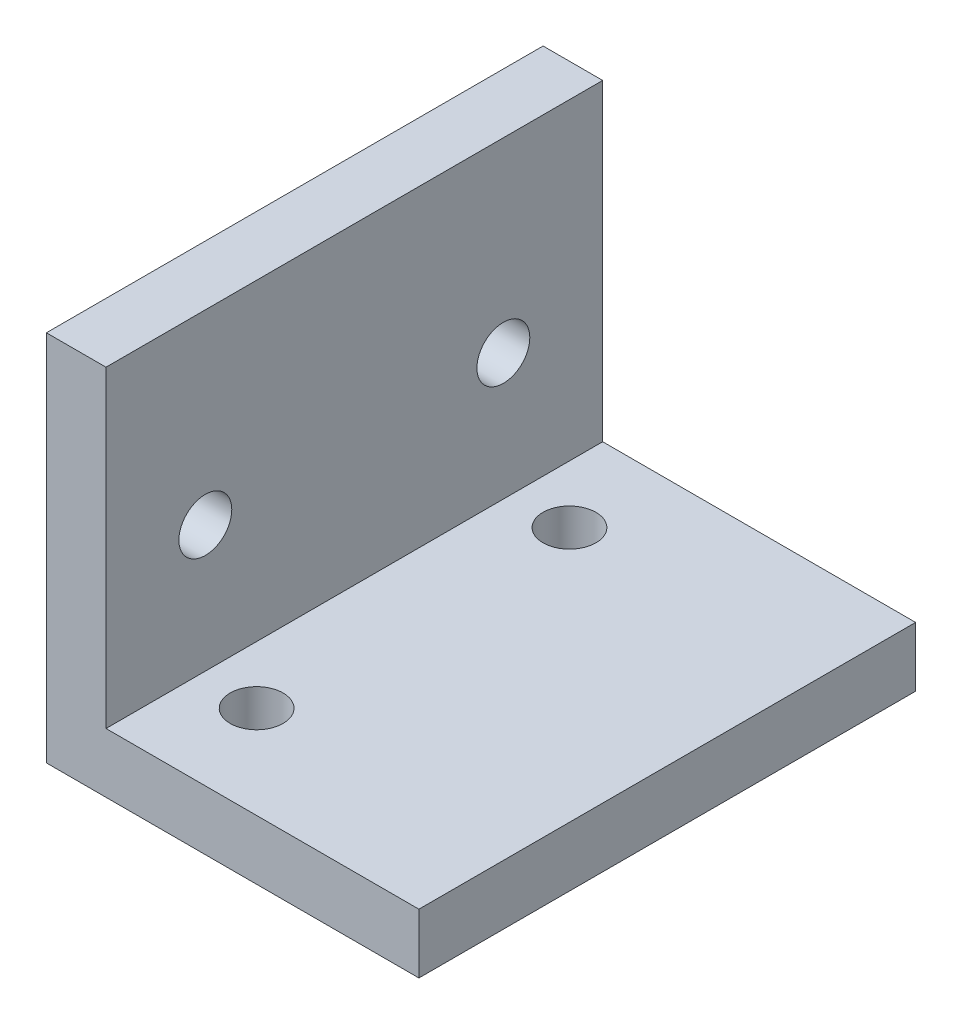
ISO-10303-21;
HEADER;
FILE_DESCRIPTION(('STEP AP214'),'2;1');
FILE_NAME('part.step','',(''),(''),'','','');
FILE_SCHEMA(('AUTOMOTIVE_DESIGN { 1 0 10303 214 1 1 1 1 }'));
ENDSEC;
DATA;
#1=APPLICATION_CONTEXT('core data for automotive mechanical design processes');
#2=APPLICATION_PROTOCOL_DEFINITION('international standard','automotive_design',2000,#1);
#3=PRODUCT_CONTEXT('',#1,'mechanical');
#4=PRODUCT('Part','Part','',(#3));
#5=PRODUCT_RELATED_PRODUCT_CATEGORY('part','',(#4));
#6=PRODUCT_DEFINITION_FORMATION('','',#4);
#7=PRODUCT_DEFINITION_CONTEXT('part definition',#1,'design');
#8=PRODUCT_DEFINITION('design','',#6,#7);
#9=PRODUCT_DEFINITION_SHAPE('','',#8);
#10=(LENGTH_UNIT() NAMED_UNIT(*) SI_UNIT(.MILLI.,.METRE.));
#11=(NAMED_UNIT(*) PLANE_ANGLE_UNIT() SI_UNIT($,.RADIAN.));
#12=(NAMED_UNIT(*) SI_UNIT($,.STERADIAN.) SOLID_ANGLE_UNIT());
#13=UNCERTAINTY_MEASURE_WITH_UNIT(LENGTH_MEASURE(1.E-05),#10,'distance_accuracy_value','');
#14=(GEOMETRIC_REPRESENTATION_CONTEXT(3) GLOBAL_UNCERTAINTY_ASSIGNED_CONTEXT((#13)) GLOBAL_UNIT_ASSIGNED_CONTEXT((#10,
#11,#12)) REPRESENTATION_CONTEXT('',''));
#15=CARTESIAN_POINT('',(0.,0.,0.));
#16=DIRECTION('',(0.,0.,1.));
#17=DIRECTION('',(1.,0.,0.));
#18=AXIS2_PLACEMENT_3D('',#15,#16,#17);
#19=CARTESIAN_POINT('',(0.,0.,25.4));
#20=DIRECTION('',(1.,0.,0.));
#21=DIRECTION('',(0.,0.,-1.));
#22=AXIS2_PLACEMENT_3D('',#19,#20,#21);
#23=PLANE('',#22);
#24=CARTESIAN_POINT('',(0.,9.525,20.32));
#25=DIRECTION('',(1.,0.,0.));
#26=DIRECTION('',(0.,0.,-1.));
#27=AXIS2_PLACEMENT_3D('',#24,#25,#26);
#28=CIRCLE('',#27,1.35255);
#29=CARTESIAN_POINT('',(0.,9.525,18.96745));
#30=VERTEX_POINT('',#29);
#31=EDGE_CURVE('E175',#30,#30,#28,.T.);
#32=ORIENTED_EDGE('',*,*,#31,.T.);
#33=EDGE_LOOP('',(#32));
#34=FACE_BOUND('',#33,.T.);
#35=CARTESIAN_POINT('',(0.,9.525,5.08));
#36=DIRECTION('',(1.,0.,0.));
#37=DIRECTION('',(0.,0.,-1.));
#38=AXIS2_PLACEMENT_3D('',#35,#36,#37);
#39=CIRCLE('',#38,1.35255);
#40=CARTESIAN_POINT('',(0.,9.525,3.72745));
#41=VERTEX_POINT('',#40);
#42=EDGE_CURVE('E132',#41,#41,#39,.T.);
#43=ORIENTED_EDGE('',*,*,#42,.T.);
#44=EDGE_LOOP('',(#43));
#45=FACE_BOUND('',#44,.T.);
#46=DIRECTION('',(0.,-1.,0.));
#47=VECTOR('',#46,1.);
#48=CARTESIAN_POINT('',(0.,0.,0.));
#49=LINE('',#48,#47);
#50=CARTESIAN_POINT('',(0.,19.05,0.));
#51=VERTEX_POINT('',#50);
#52=CARTESIAN_POINT('',(0.,0.,0.));
#53=VERTEX_POINT('',#52);
#54=EDGE_CURVE('E128',#51,#53,#49,.T.);
#55=ORIENTED_EDGE('',*,*,#54,.T.);
#56=DIRECTION('',(0.,0.,-1.));
#57=VECTOR('',#56,1.);
#58=CARTESIAN_POINT('',(0.,0.,25.4));
#59=LINE('',#58,#57);
#60=CARTESIAN_POINT('',(0.,0.,25.4));
#61=VERTEX_POINT('',#60);
#62=EDGE_CURVE('E13',#61,#53,#59,.T.);
#63=ORIENTED_EDGE('',*,*,#62,.F.);
#64=DIRECTION('',(0.,-1.,0.));
#65=VECTOR('',#64,1.);
#66=CARTESIAN_POINT('',(0.,0.,25.4));
#67=LINE('',#66,#65);
#68=CARTESIAN_POINT('',(0.,19.05,25.4));
#69=VERTEX_POINT('',#68);
#70=EDGE_CURVE('E139',#69,#61,#67,.T.);
#71=ORIENTED_EDGE('',*,*,#70,.F.);
#72=DIRECTION('',(0.,0.,-1.));
#73=VECTOR('',#72,1.);
#74=CARTESIAN_POINT('',(0.,19.05,25.4));
#75=LINE('',#74,#73);
#76=EDGE_CURVE('E124',#69,#51,#75,.T.);
#77=ORIENTED_EDGE('',*,*,#76,.T.);
#78=EDGE_LOOP('',(#55,#63,#71,#77));
#79=FACE_BOUND('',#78,.T.);
#80=ADVANCED_FACE('F44',(#34,#45,#79),#23,.F.);
#81=CARTESIAN_POINT('',(0.,0.,25.4));
#82=DIRECTION('',(0.,1.,0.));
#83=DIRECTION('',(0.,0.,1.));
#84=AXIS2_PLACEMENT_3D('',#81,#82,#83);
#85=PLANE('',#84);
#86=CARTESIAN_POINT('',(6.00000000000003,0.,20.65));
#87=DIRECTION('',(0.,1.,0.));
#88=DIRECTION('',(0.,0.,1.));
#89=AXIS2_PLACEMENT_3D('',#86,#87,#88);
#90=CIRCLE('',#89,1.35255);
#91=CARTESIAN_POINT('',(6.00000000000003,0.,22.00255));
#92=VERTEX_POINT('',#91);
#93=EDGE_CURVE('E196',#92,#92,#90,.T.);
#94=ORIENTED_EDGE('',*,*,#93,.T.);
#95=EDGE_LOOP('',(#94));
#96=FACE_BOUND('',#95,.T.);
#97=CARTESIAN_POINT('',(6.00000000000003,0.,4.65000000000003));
#98=DIRECTION('',(0.,1.,0.));
#99=DIRECTION('',(0.,0.,1.));
#100=AXIS2_PLACEMENT_3D('',#97,#98,#99);
#101=CIRCLE('',#100,1.35255);
#102=CARTESIAN_POINT('',(6.00000000000003,0.,6.00255000000003));
#103=VERTEX_POINT('',#102);
#104=EDGE_CURVE('E190',#103,#103,#101,.T.);
#105=ORIENTED_EDGE('',*,*,#104,.T.);
#106=EDGE_LOOP('',(#105));
#107=FACE_BOUND('',#106,.T.);
#108=DIRECTION('',(1.,0.,0.));
#109=VECTOR('',#108,1.);
#110=CARTESIAN_POINT('',(0.,0.,0.));
#111=LINE('',#110,#109);
#112=CARTESIAN_POINT('',(19.05,0.,0.));
#113=VERTEX_POINT('',#112);
#114=EDGE_CURVE('E131',#53,#113,#111,.T.);
#115=ORIENTED_EDGE('',*,*,#114,.T.);
#116=DIRECTION('',(0.,0.,-1.));
#117=VECTOR('',#116,1.);
#118=CARTESIAN_POINT('',(19.05,0.,25.4));
#119=LINE('',#118,#117);
#120=CARTESIAN_POINT('',(19.05,0.,25.4));
#121=VERTEX_POINT('',#120);
#122=EDGE_CURVE('E52',#121,#113,#119,.T.);
#123=ORIENTED_EDGE('',*,*,#122,.F.);
#124=DIRECTION('',(1.,0.,0.));
#125=VECTOR('',#124,1.);
#126=CARTESIAN_POINT('',(0.,0.,25.4));
#127=LINE('',#126,#125);
#128=EDGE_CURVE('E97',#61,#121,#127,.T.);
#129=ORIENTED_EDGE('',*,*,#128,.F.);
#130=ORIENTED_EDGE('',*,*,#62,.T.);
#131=EDGE_LOOP('',(#115,#123,#129,#130));
#132=FACE_BOUND('',#131,.T.);
#133=ADVANCED_FACE('F165',(#96,#107,#132),#85,.F.);
#134=CARTESIAN_POINT('',(19.05,0.,25.4));
#135=DIRECTION('',(-1.,0.,0.));
#136=DIRECTION('',(0.,-1.,0.));
#137=AXIS2_PLACEMENT_3D('',#134,#135,#136);
#138=PLANE('',#137);
#139=DIRECTION('',(0.,1.,0.));
#140=VECTOR('',#139,1.);
#141=CARTESIAN_POINT('',(19.05,0.,0.));
#142=LINE('',#141,#140);
#143=CARTESIAN_POINT('',(19.05,3.048,0.));
#144=VERTEX_POINT('',#143);
#145=EDGE_CURVE('E134',#113,#144,#142,.T.);
#146=ORIENTED_EDGE('',*,*,#145,.T.);
#147=DIRECTION('',(0.,0.,-1.));
#148=VECTOR('',#147,1.);
#149=CARTESIAN_POINT('',(19.05,3.048,25.4));
#150=LINE('',#149,#148);
#151=CARTESIAN_POINT('',(19.05,3.048,25.4));
#152=VERTEX_POINT('',#151);
#153=EDGE_CURVE('E119',#152,#144,#150,.T.);
#154=ORIENTED_EDGE('',*,*,#153,.F.);
#155=DIRECTION('',(0.,1.,0.));
#156=VECTOR('',#155,1.);
#157=CARTESIAN_POINT('',(19.05,0.,25.4));
#158=LINE('',#157,#156);
#159=EDGE_CURVE('E110',#121,#152,#158,.T.);
#160=ORIENTED_EDGE('',*,*,#159,.F.);
#161=ORIENTED_EDGE('',*,*,#122,.T.);
#162=EDGE_LOOP('',(#146,#154,#160,#161));
#163=FACE_BOUND('',#162,.T.);
#164=ADVANCED_FACE('F145',(#163),#138,.F.);
#165=CARTESIAN_POINT('',(19.05,3.048,25.4));
#166=DIRECTION('',(0.,-1.,0.));
#167=DIRECTION('',(1.,0.,0.));
#168=AXIS2_PLACEMENT_3D('',#165,#166,#167);
#169=PLANE('',#168);
#170=CARTESIAN_POINT('',(6.00000000000003,3.048,20.65));
#171=DIRECTION('',(0.,1.,0.));
#172=DIRECTION('',(0.,0.,1.));
#173=AXIS2_PLACEMENT_3D('',#170,#171,#172);
#174=CIRCLE('',#173,1.35254999999999);
#175=CARTESIAN_POINT('',(6.00000000000003,3.048,22.00255));
#176=VERTEX_POINT('',#175);
#177=EDGE_CURVE('E199',#176,#176,#174,.T.);
#178=ORIENTED_EDGE('',*,*,#177,.F.);
#179=EDGE_LOOP('',(#178));
#180=FACE_BOUND('',#179,.T.);
#181=CARTESIAN_POINT('',(6.00000000000003,3.048,4.65000000000003));
#182=DIRECTION('',(0.,1.,0.));
#183=DIRECTION('',(0.,0.,1.));
#184=AXIS2_PLACEMENT_3D('',#181,#182,#183);
#185=CIRCLE('',#184,1.35254999999999);
#186=CARTESIAN_POINT('',(6.00000000000003,3.048,6.00255000000002));
#187=VERTEX_POINT('',#186);
#188=EDGE_CURVE('E193',#187,#187,#185,.T.);
#189=ORIENTED_EDGE('',*,*,#188,.F.);
#190=EDGE_LOOP('',(#189));
#191=FACE_BOUND('',#190,.T.);
#192=DIRECTION('',(-1.,0.,0.));
#193=VECTOR('',#192,1.);
#194=CARTESIAN_POINT('',(19.05,3.048,0.));
#195=LINE('',#194,#193);
#196=CARTESIAN_POINT('',(3.048,3.048,0.));
#197=VERTEX_POINT('',#196);
#198=EDGE_CURVE('E118',#144,#197,#195,.T.);
#199=ORIENTED_EDGE('',*,*,#198,.T.);
#200=DIRECTION('',(0.,0.,-1.));
#201=VECTOR('',#200,1.);
#202=CARTESIAN_POINT('',(3.048,3.048,25.4));
#203=LINE('',#202,#201);
#204=CARTESIAN_POINT('',(3.048,3.048,25.4));
#205=VERTEX_POINT('',#204);
#206=EDGE_CURVE('E115',#205,#197,#203,.T.);
#207=ORIENTED_EDGE('',*,*,#206,.F.);
#208=DIRECTION('',(-1.,0.,0.));
#209=VECTOR('',#208,1.);
#210=CARTESIAN_POINT('',(19.05,3.048,25.4));
#211=LINE('',#210,#209);
#212=EDGE_CURVE('E104',#152,#205,#211,.T.);
#213=ORIENTED_EDGE('',*,*,#212,.F.);
#214=ORIENTED_EDGE('',*,*,#153,.T.);
#215=EDGE_LOOP('',(#199,#207,#213,#214));
#216=FACE_BOUND('',#215,.T.);
#217=ADVANCED_FACE('F116',(#180,#191,#216),#169,.F.);
#218=CARTESIAN_POINT('',(3.048,19.05,25.4));
#219=DIRECTION('',(-1.,0.,0.));
#220=DIRECTION('',(0.,-1.,0.));
#221=AXIS2_PLACEMENT_3D('',#218,#219,#220);
#222=PLANE('',#221);
#223=CARTESIAN_POINT('',(3.048,9.525,20.32));
#224=DIRECTION('',(1.,0.,0.));
#225=DIRECTION('',(0.,0.,-1.));
#226=AXIS2_PLACEMENT_3D('',#223,#224,#225);
#227=CIRCLE('',#226,1.35254999999999);
#228=CARTESIAN_POINT('',(3.048,9.525,18.96745));
#229=VERTEX_POINT('',#228);
#230=EDGE_CURVE('E187',#229,#229,#227,.T.);
#231=ORIENTED_EDGE('',*,*,#230,.F.);
#232=EDGE_LOOP('',(#231));
#233=FACE_BOUND('',#232,.T.);
#234=CARTESIAN_POINT('',(3.048,9.525,5.08));
#235=DIRECTION('',(1.,0.,0.));
#236=DIRECTION('',(0.,0.,-1.));
#237=AXIS2_PLACEMENT_3D('',#234,#235,#236);
#238=CIRCLE('',#237,1.35254999999999);
#239=CARTESIAN_POINT('',(3.048,9.525,3.72745000000001));
#240=VERTEX_POINT('',#239);
#241=EDGE_CURVE('E179',#240,#240,#238,.T.);
#242=ORIENTED_EDGE('',*,*,#241,.F.);
#243=EDGE_LOOP('',(#242));
#244=FACE_BOUND('',#243,.T.);
#245=DIRECTION('',(0.,1.,0.));
#246=VECTOR('',#245,1.);
#247=CARTESIAN_POINT('',(3.048,19.05,0.));
#248=LINE('',#247,#246);
#249=CARTESIAN_POINT('',(3.048,19.05,0.));
#250=VERTEX_POINT('',#249);
#251=EDGE_CURVE('E83',#197,#250,#248,.T.);
#252=ORIENTED_EDGE('',*,*,#251,.T.);
#253=DIRECTION('',(0.,0.,-1.));
#254=VECTOR('',#253,1.);
#255=CARTESIAN_POINT('',(3.048,19.05,25.4));
#256=LINE('',#255,#254);
#257=CARTESIAN_POINT('',(3.048,19.05,25.4));
#258=VERTEX_POINT('',#257);
#259=EDGE_CURVE('E120',#258,#250,#256,.T.);
#260=ORIENTED_EDGE('',*,*,#259,.F.);
#261=DIRECTION('',(0.,1.,0.));
#262=VECTOR('',#261,1.);
#263=CARTESIAN_POINT('',(3.048,19.05,25.4));
#264=LINE('',#263,#262);
#265=EDGE_CURVE('E108',#205,#258,#264,.T.);
#266=ORIENTED_EDGE('',*,*,#265,.F.);
#267=ORIENTED_EDGE('',*,*,#206,.T.);
#268=EDGE_LOOP('',(#252,#260,#266,#267));
#269=FACE_BOUND('',#268,.T.);
#270=ADVANCED_FACE('F122',(#233,#244,#269),#222,.F.);
#271=CARTESIAN_POINT('',(0.,19.05,25.4));
#272=DIRECTION('',(0.,-1.,0.));
#273=DIRECTION('',(1.,0.,0.));
#274=AXIS2_PLACEMENT_3D('',#271,#272,#273);
#275=PLANE('',#274);
#276=DIRECTION('',(-1.,0.,0.));
#277=VECTOR('',#276,1.);
#278=CARTESIAN_POINT('',(0.,19.05,0.));
#279=LINE('',#278,#277);
#280=EDGE_CURVE('E89',#250,#51,#279,.T.);
#281=ORIENTED_EDGE('',*,*,#280,.T.);
#282=ORIENTED_EDGE('',*,*,#76,.F.);
#283=DIRECTION('',(-1.,0.,0.));
#284=VECTOR('',#283,1.);
#285=CARTESIAN_POINT('',(0.,19.05,25.4));
#286=LINE('',#285,#284);
#287=EDGE_CURVE('E60',#258,#69,#286,.T.);
#288=ORIENTED_EDGE('',*,*,#287,.F.);
#289=ORIENTED_EDGE('',*,*,#259,.T.);
#290=EDGE_LOOP('',(#281,#282,#288,#289));
#291=FACE_BOUND('',#290,.T.);
#292=ADVANCED_FACE('F152',(#291),#275,.F.);
#293=CARTESIAN_POINT('',(0.,0.,25.4));
#294=DIRECTION('',(0.,0.,-1.));
#295=DIRECTION('',(-1.,0.,0.));
#296=AXIS2_PLACEMENT_3D('',#293,#294,#295);
#297=PLANE('',#296);
#298=ORIENTED_EDGE('',*,*,#70,.T.);
#299=ORIENTED_EDGE('',*,*,#128,.T.);
#300=ORIENTED_EDGE('',*,*,#159,.T.);
#301=ORIENTED_EDGE('',*,*,#212,.T.);
#302=ORIENTED_EDGE('',*,*,#265,.T.);
#303=ORIENTED_EDGE('',*,*,#287,.T.);
#304=EDGE_LOOP('',(#298,#299,#300,#301,#302,#303));
#305=FACE_BOUND('',#304,.T.);
#306=ADVANCED_FACE('F106',(#305),#297,.F.);
#307=CARTESIAN_POINT('',(0.,0.,0.));
#308=DIRECTION('',(0.,0.,-1.));
#309=DIRECTION('',(-1.,0.,0.));
#310=AXIS2_PLACEMENT_3D('',#307,#308,#309);
#311=PLANE('',#310);
#312=ORIENTED_EDGE('',*,*,#54,.F.);
#313=ORIENTED_EDGE('',*,*,#280,.F.);
#314=ORIENTED_EDGE('',*,*,#251,.F.);
#315=ORIENTED_EDGE('',*,*,#198,.F.);
#316=ORIENTED_EDGE('',*,*,#145,.F.);
#317=ORIENTED_EDGE('',*,*,#114,.F.);
#318=EDGE_LOOP('',(#312,#313,#314,#315,#316,#317));
#319=FACE_BOUND('',#318,.T.);
#320=ADVANCED_FACE('F148',(#319),#311,.T.);
#321=CARTESIAN_POINT('',(3.048,9.525,5.08));
#322=DIRECTION('',(1.,0.,0.));
#323=DIRECTION('',(0.,0.,-1.));
#324=AXIS2_PLACEMENT_3D('',#321,#322,#323);
#325=CYLINDRICAL_SURFACE('',#324,1.35254999999999);
#326=ORIENTED_EDGE('',*,*,#42,.F.);
#327=EDGE_LOOP('',(#326));
#328=FACE_BOUND('',#327,.T.);
#329=ORIENTED_EDGE('',*,*,#241,.T.);
#330=EDGE_LOOP('',(#329));
#331=FACE_BOUND('',#330,.T.);
#332=ADVANCED_FACE('F221',(#328,#331),#325,.F.);
#333=CARTESIAN_POINT('',(3.048,9.525,20.32));
#334=DIRECTION('',(1.,0.,0.));
#335=DIRECTION('',(0.,0.,-1.));
#336=AXIS2_PLACEMENT_3D('',#333,#334,#335);
#337=CYLINDRICAL_SURFACE('',#336,1.35254999999999);
#338=ORIENTED_EDGE('',*,*,#31,.F.);
#339=EDGE_LOOP('',(#338));
#340=FACE_BOUND('',#339,.T.);
#341=ORIENTED_EDGE('',*,*,#230,.T.);
#342=EDGE_LOOP('',(#341));
#343=FACE_BOUND('',#342,.T.);
#344=ADVANCED_FACE('F212',(#340,#343),#337,.F.);
#345=CARTESIAN_POINT('',(6.00000000000003,3.048,4.65000000000003));
#346=DIRECTION('',(0.,1.,0.));
#347=DIRECTION('',(0.,0.,1.));
#348=AXIS2_PLACEMENT_3D('',#345,#346,#347);
#349=CYLINDRICAL_SURFACE('',#348,1.35254999999999);
#350=ORIENTED_EDGE('',*,*,#104,.F.);
#351=EDGE_LOOP('',(#350));
#352=FACE_BOUND('',#351,.T.);
#353=ORIENTED_EDGE('',*,*,#188,.T.);
#354=EDGE_LOOP('',(#353));
#355=FACE_BOUND('',#354,.T.);
#356=ADVANCED_FACE('F210',(#352,#355),#349,.F.);
#357=CARTESIAN_POINT('',(6.00000000000003,3.048,20.65));
#358=DIRECTION('',(0.,1.,0.));
#359=DIRECTION('',(0.,0.,1.));
#360=AXIS2_PLACEMENT_3D('',#357,#358,#359);
#361=CYLINDRICAL_SURFACE('',#360,1.35254999999999);
#362=ORIENTED_EDGE('',*,*,#93,.F.);
#363=EDGE_LOOP('',(#362));
#364=FACE_BOUND('',#363,.T.);
#365=ORIENTED_EDGE('',*,*,#177,.T.);
#366=EDGE_LOOP('',(#365));
#367=FACE_BOUND('',#366,.T.);
#368=ADVANCED_FACE('F203',(#364,#367),#361,.F.);
#369=CLOSED_SHELL('',(#80,#133,#164,#217,#270,#292,#306,#320,#332,#344,#356,#368));
#370=MANIFOLD_SOLID_BREP('B2',#369);
#371=ADVANCED_BREP_SHAPE_REPRESENTATION('',(#18,#370),#14);
#372=SHAPE_DEFINITION_REPRESENTATION(#9,#371);
ENDSEC;
END-ISO-10303-21;
